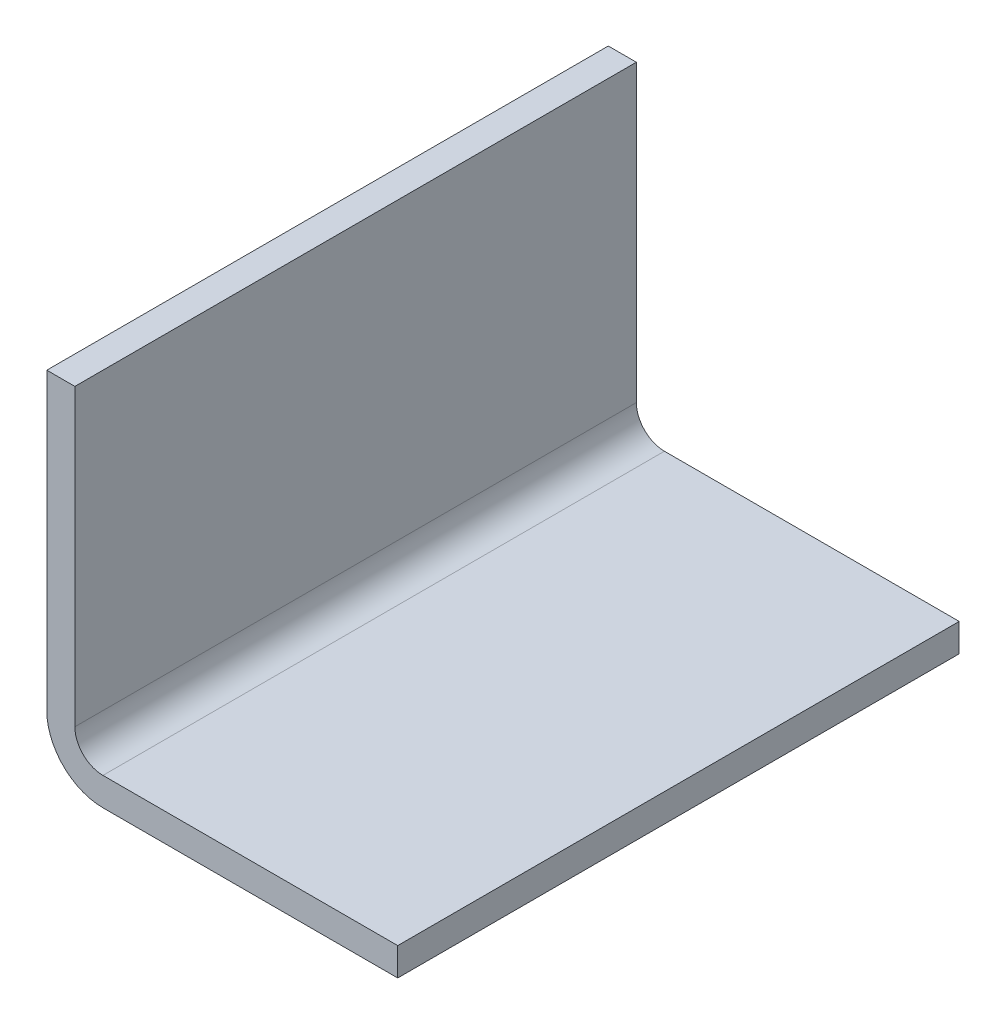
ISO-10303-21;
HEADER;
FILE_DESCRIPTION(('STEP AP214'),'2;1');
FILE_NAME('part.step','',(''),(''),'','','');
FILE_SCHEMA(('AUTOMOTIVE_DESIGN { 1 0 10303 214 1 1 1 1 }'));
ENDSEC;
DATA;
#1=APPLICATION_CONTEXT('core data for automotive mechanical design processes');
#2=APPLICATION_PROTOCOL_DEFINITION('international standard','automotive_design',2000,#1);
#3=PRODUCT_CONTEXT('',#1,'mechanical');
#4=PRODUCT('Part','Part','',(#3));
#5=PRODUCT_RELATED_PRODUCT_CATEGORY('part','',(#4));
#6=PRODUCT_DEFINITION_FORMATION('','',#4);
#7=PRODUCT_DEFINITION_CONTEXT('part definition',#1,'design');
#8=PRODUCT_DEFINITION('design','',#6,#7);
#9=PRODUCT_DEFINITION_SHAPE('','',#8);
#10=(LENGTH_UNIT() NAMED_UNIT(*) SI_UNIT(.MILLI.,.METRE.));
#11=(NAMED_UNIT(*) PLANE_ANGLE_UNIT() SI_UNIT($,.RADIAN.));
#12=(NAMED_UNIT(*) SI_UNIT($,.STERADIAN.) SOLID_ANGLE_UNIT());
#13=UNCERTAINTY_MEASURE_WITH_UNIT(LENGTH_MEASURE(1.E-05),#10,'distance_accuracy_value','');
#14=(GEOMETRIC_REPRESENTATION_CONTEXT(3) GLOBAL_UNCERTAINTY_ASSIGNED_CONTEXT((#13)) GLOBAL_UNIT_ASSIGNED_CONTEXT((#10,
#11,#12)) REPRESENTATION_CONTEXT('',''));
#15=CARTESIAN_POINT('',(0.,0.,0.));
#16=DIRECTION('',(0.,0.,1.));
#17=DIRECTION('',(1.,0.,0.));
#18=AXIS2_PLACEMENT_3D('',#15,#16,#17);
#19=CARTESIAN_POINT('',(0.,25.,20.));
#20=DIRECTION('',(0.,-1.,0.));
#21=DIRECTION('',(0.,0.,-1.));
#22=AXIS2_PLACEMENT_3D('',#19,#20,#21);
#23=PLANE('',#22);
#24=DIRECTION('',(-1.,0.,0.));
#25=VECTOR('',#24,1.);
#26=CARTESIAN_POINT('',(0.,25.,-20.));
#27=LINE('',#26,#25);
#28=CARTESIAN_POINT('',(2.,25.,-20.));
#29=VERTEX_POINT('',#28);
#30=CARTESIAN_POINT('',(0.,25.,-20.));
#31=VERTEX_POINT('',#30);
#32=EDGE_CURVE('E134',#29,#31,#27,.T.);
#33=ORIENTED_EDGE('',*,*,#32,.T.);
#34=DIRECTION('',(0.,0.,-1.));
#35=VECTOR('',#34,1.);
#36=CARTESIAN_POINT('',(0.,25.,20.));
#37=LINE('',#36,#35);
#38=CARTESIAN_POINT('',(0.,25.,20.));
#39=VERTEX_POINT('',#38);
#40=EDGE_CURVE('E11',#39,#31,#37,.T.);
#41=ORIENTED_EDGE('',*,*,#40,.F.);
#42=DIRECTION('',(-1.,0.,0.));
#43=VECTOR('',#42,1.);
#44=CARTESIAN_POINT('',(0.,25.,20.));
#45=LINE('',#44,#43);
#46=CARTESIAN_POINT('',(2.,25.,20.));
#47=VERTEX_POINT('',#46);
#48=EDGE_CURVE('E148',#47,#39,#45,.T.);
#49=ORIENTED_EDGE('',*,*,#48,.F.);
#50=DIRECTION('',(0.,0.,-1.));
#51=VECTOR('',#50,1.);
#52=CARTESIAN_POINT('',(2.,25.,20.));
#53=LINE('',#52,#51);
#54=EDGE_CURVE('E130',#47,#29,#53,.T.);
#55=ORIENTED_EDGE('',*,*,#54,.T.);
#56=EDGE_LOOP('',(#33,#41,#49,#55));
#57=FACE_BOUND('',#56,.T.);
#58=ADVANCED_FACE('F38',(#57),#23,.F.);
#59=CARTESIAN_POINT('',(0.,4.,20.));
#60=DIRECTION('',(1.,0.,0.));
#61=DIRECTION('',(0.,1.,0.));
#62=AXIS2_PLACEMENT_3D('',#59,#60,#61);
#63=PLANE('',#62);
#64=DIRECTION('',(0.,-1.,0.));
#65=VECTOR('',#64,1.);
#66=CARTESIAN_POINT('',(0.,4.,-20.));
#67=LINE('',#66,#65);
#68=CARTESIAN_POINT('',(0.,4.,-20.));
#69=VERTEX_POINT('',#68);
#70=EDGE_CURVE('E137',#31,#69,#67,.T.);
#71=ORIENTED_EDGE('',*,*,#70,.T.);
#72=DIRECTION('',(0.,0.,-1.));
#73=VECTOR('',#72,1.);
#74=CARTESIAN_POINT('',(0.,4.,20.));
#75=LINE('',#74,#73);
#76=CARTESIAN_POINT('',(0.,4.,20.));
#77=VERTEX_POINT('',#76);
#78=EDGE_CURVE('E46',#77,#69,#75,.T.);
#79=ORIENTED_EDGE('',*,*,#78,.F.);
#80=DIRECTION('',(0.,-1.,0.));
#81=VECTOR('',#80,1.);
#82=CARTESIAN_POINT('',(0.,4.,20.));
#83=LINE('',#82,#81);
#84=EDGE_CURVE('E97',#39,#77,#83,.T.);
#85=ORIENTED_EDGE('',*,*,#84,.F.);
#86=ORIENTED_EDGE('',*,*,#40,.T.);
#87=EDGE_LOOP('',(#71,#79,#85,#86));
#88=FACE_BOUND('',#87,.T.);
#89=ADVANCED_FACE('F183',(#88),#63,.F.);
#90=CARTESIAN_POINT('',(4.,4.,20.));
#91=DIRECTION('',(0.,0.,-1.));
#92=DIRECTION('',(-1.,0.,0.));
#93=AXIS2_PLACEMENT_3D('',#90,#91,#92);
#94=CYLINDRICAL_SURFACE('',#93,4.);
#95=CARTESIAN_POINT('',(4.,4.,-20.));
#96=DIRECTION('',(0.,0.,1.));
#97=DIRECTION('',(1.,0.,0.));
#98=AXIS2_PLACEMENT_3D('',#95,#96,#97);
#99=CIRCLE('',#98,4.);
#100=CARTESIAN_POINT('',(4.,0.,-20.));
#101=VERTEX_POINT('',#100);
#102=EDGE_CURVE('E139',#69,#101,#99,.T.);
#103=ORIENTED_EDGE('',*,*,#102,.T.);
#104=DIRECTION('',(0.,0.,-1.));
#105=VECTOR('',#104,1.);
#106=CARTESIAN_POINT('',(4.,0.,20.));
#107=LINE('',#106,#105);
#108=CARTESIAN_POINT('',(4.,0.,20.));
#109=VERTEX_POINT('',#108);
#110=EDGE_CURVE('E155',#109,#101,#107,.T.);
#111=ORIENTED_EDGE('',*,*,#110,.F.);
#112=CARTESIAN_POINT('',(4.,4.,20.));
#113=DIRECTION('',(0.,0.,1.));
#114=DIRECTION('',(1.,0.,0.));
#115=AXIS2_PLACEMENT_3D('',#112,#113,#114);
#116=CIRCLE('',#115,4.);
#117=EDGE_CURVE('E163',#77,#109,#116,.T.);
#118=ORIENTED_EDGE('',*,*,#117,.F.);
#119=ORIENTED_EDGE('',*,*,#78,.T.);
#120=EDGE_LOOP('',(#103,#111,#118,#119));
#121=FACE_BOUND('',#120,.T.);
#122=ADVANCED_FACE('F161',(#121),#94,.T.);
#123=CARTESIAN_POINT('',(25.,0.,20.));
#124=DIRECTION('',(0.,1.,0.));
#125=DIRECTION('',(-1.,0.,0.));
#126=AXIS2_PLACEMENT_3D('',#123,#124,#125);
#127=PLANE('',#126);
#128=DIRECTION('',(1.,0.,0.));
#129=VECTOR('',#128,1.);
#130=CARTESIAN_POINT('',(25.,0.,-20.));
#131=LINE('',#130,#129);
#132=CARTESIAN_POINT('',(25.,0.,-20.));
#133=VERTEX_POINT('',#132);
#134=EDGE_CURVE('E141',#101,#133,#131,.T.);
#135=ORIENTED_EDGE('',*,*,#134,.T.);
#136=DIRECTION('',(0.,0.,-1.));
#137=VECTOR('',#136,1.);
#138=CARTESIAN_POINT('',(25.,0.,20.));
#139=LINE('',#138,#137);
#140=CARTESIAN_POINT('',(25.,0.,20.));
#141=VERTEX_POINT('',#140);
#142=EDGE_CURVE('E152',#141,#133,#139,.T.);
#143=ORIENTED_EDGE('',*,*,#142,.F.);
#144=DIRECTION('',(1.,0.,0.));
#145=VECTOR('',#144,1.);
#146=CARTESIAN_POINT('',(25.,0.,20.));
#147=LINE('',#146,#145);
#148=EDGE_CURVE('E175',#109,#141,#147,.T.);
#149=ORIENTED_EDGE('',*,*,#148,.F.);
#150=ORIENTED_EDGE('',*,*,#110,.T.);
#151=EDGE_LOOP('',(#135,#143,#149,#150));
#152=FACE_BOUND('',#151,.T.);
#153=ADVANCED_FACE('F171',(#152),#127,.F.);
#154=CARTESIAN_POINT('',(25.,2.,20.));
#155=DIRECTION('',(-1.,0.,0.));
#156=DIRECTION('',(0.,0.,1.));
#157=AXIS2_PLACEMENT_3D('',#154,#155,#156);
#158=PLANE('',#157);
#159=DIRECTION('',(0.,1.,0.));
#160=VECTOR('',#159,1.);
#161=CARTESIAN_POINT('',(25.,2.,-20.));
#162=LINE('',#161,#160);
#163=CARTESIAN_POINT('',(25.,2.,-20.));
#164=VERTEX_POINT('',#163);
#165=EDGE_CURVE('E143',#133,#164,#162,.T.);
#166=ORIENTED_EDGE('',*,*,#165,.T.);
#167=DIRECTION('',(0.,0.,-1.));
#168=VECTOR('',#167,1.);
#169=CARTESIAN_POINT('',(25.,2.,20.));
#170=LINE('',#169,#168);
#171=CARTESIAN_POINT('',(25.,2.,20.));
#172=VERTEX_POINT('',#171);
#173=EDGE_CURVE('E125',#172,#164,#170,.T.);
#174=ORIENTED_EDGE('',*,*,#173,.F.);
#175=DIRECTION('',(0.,1.,0.));
#176=VECTOR('',#175,1.);
#177=CARTESIAN_POINT('',(25.,2.,20.));
#178=LINE('',#177,#176);
#179=EDGE_CURVE('E116',#141,#172,#178,.T.);
#180=ORIENTED_EDGE('',*,*,#179,.F.);
#181=ORIENTED_EDGE('',*,*,#142,.T.);
#182=EDGE_LOOP('',(#166,#174,#180,#181));
#183=FACE_BOUND('',#182,.T.);
#184=ADVANCED_FACE('F174',(#183),#158,.F.);
#185=CARTESIAN_POINT('',(4.00000000000002,2.,20.));
#186=DIRECTION('',(0.,-1.,0.));
#187=DIRECTION('',(0.,0.,-1.));
#188=AXIS2_PLACEMENT_3D('',#185,#186,#187);
#189=PLANE('',#188);
#190=DIRECTION('',(-1.,0.,0.));
#191=VECTOR('',#190,1.);
#192=CARTESIAN_POINT('',(4.00000000000002,2.,-20.));
#193=LINE('',#192,#191);
#194=CARTESIAN_POINT('',(4.00000000000002,2.,-20.));
#195=VERTEX_POINT('',#194);
#196=EDGE_CURVE('E124',#164,#195,#193,.T.);
#197=ORIENTED_EDGE('',*,*,#196,.T.);
#198=DIRECTION('',(0.,0.,-1.));
#199=VECTOR('',#198,1.);
#200=CARTESIAN_POINT('',(4.00000000000002,2.,20.));
#201=LINE('',#200,#199);
#202=CARTESIAN_POINT('',(4.00000000000002,2.,20.));
#203=VERTEX_POINT('',#202);
#204=EDGE_CURVE('E121',#203,#195,#201,.T.);
#205=ORIENTED_EDGE('',*,*,#204,.F.);
#206=DIRECTION('',(-1.,0.,0.));
#207=VECTOR('',#206,1.);
#208=CARTESIAN_POINT('',(4.00000000000002,2.,20.));
#209=LINE('',#208,#207);
#210=EDGE_CURVE('E110',#172,#203,#209,.T.);
#211=ORIENTED_EDGE('',*,*,#210,.F.);
#212=ORIENTED_EDGE('',*,*,#173,.T.);
#213=EDGE_LOOP('',(#197,#205,#211,#212));
#214=FACE_BOUND('',#213,.T.);
#215=ADVANCED_FACE('F122',(#214),#189,.F.);
#216=CARTESIAN_POINT('',(4.,4.,20.));
#217=DIRECTION('',(0.,0.,-1.));
#218=DIRECTION('',(-1.,0.,0.));
#219=AXIS2_PLACEMENT_3D('',#216,#217,#218);
#220=CYLINDRICAL_SURFACE('',#219,2.);
#221=CARTESIAN_POINT('',(4.,4.,-20.));
#222=DIRECTION('',(0.,0.,-1.));
#223=DIRECTION('',(1.,0.,0.));
#224=AXIS2_PLACEMENT_3D('',#221,#222,#223);
#225=CIRCLE('',#224,2.);
#226=CARTESIAN_POINT('',(2.,4.00000000000001,-20.));
#227=VERTEX_POINT('',#226);
#228=EDGE_CURVE('E83',#195,#227,#225,.T.);
#229=ORIENTED_EDGE('',*,*,#228,.T.);
#230=DIRECTION('',(0.,0.,-1.));
#231=VECTOR('',#230,1.);
#232=CARTESIAN_POINT('',(2.,4.00000000000001,20.));
#233=LINE('',#232,#231);
#234=CARTESIAN_POINT('',(2.,4.00000000000001,20.));
#235=VERTEX_POINT('',#234);
#236=EDGE_CURVE('E126',#235,#227,#233,.T.);
#237=ORIENTED_EDGE('',*,*,#236,.F.);
#238=CARTESIAN_POINT('',(4.,4.,20.));
#239=DIRECTION('',(0.,0.,-1.));
#240=DIRECTION('',(1.,0.,0.));
#241=AXIS2_PLACEMENT_3D('',#238,#239,#240);
#242=CIRCLE('',#241,2.);
#243=EDGE_CURVE('E114',#203,#235,#242,.T.);
#244=ORIENTED_EDGE('',*,*,#243,.F.);
#245=ORIENTED_EDGE('',*,*,#204,.T.);
#246=EDGE_LOOP('',(#229,#237,#244,#245));
#247=FACE_BOUND('',#246,.T.);
#248=ADVANCED_FACE('F128',(#247),#220,.F.);
#249=CARTESIAN_POINT('',(2.,25.,20.));
#250=DIRECTION('',(-1.,0.,0.));
#251=DIRECTION('',(0.,-1.,0.));
#252=AXIS2_PLACEMENT_3D('',#249,#250,#251);
#253=PLANE('',#252);
#254=DIRECTION('',(0.,1.,0.));
#255=VECTOR('',#254,1.);
#256=CARTESIAN_POINT('',(2.,25.,-20.));
#257=LINE('',#256,#255);
#258=EDGE_CURVE('E89',#227,#29,#257,.T.);
#259=ORIENTED_EDGE('',*,*,#258,.T.);
#260=ORIENTED_EDGE('',*,*,#54,.F.);
#261=DIRECTION('',(0.,1.,0.));
#262=VECTOR('',#261,1.);
#263=CARTESIAN_POINT('',(2.,25.,20.));
#264=LINE('',#263,#262);
#265=EDGE_CURVE('E54',#235,#47,#264,.T.);
#266=ORIENTED_EDGE('',*,*,#265,.F.);
#267=ORIENTED_EDGE('',*,*,#236,.T.);
#268=EDGE_LOOP('',(#259,#260,#266,#267));
#269=FACE_BOUND('',#268,.T.);
#270=ADVANCED_FACE('F199',(#269),#253,.F.);
#271=CARTESIAN_POINT('',(4.,4.,20.));
#272=DIRECTION('',(0.,0.,1.));
#273=DIRECTION('',(1.,0.,0.));
#274=AXIS2_PLACEMENT_3D('',#271,#272,#273);
#275=PLANE('',#274);
#276=ORIENTED_EDGE('',*,*,#48,.T.);
#277=ORIENTED_EDGE('',*,*,#84,.T.);
#278=ORIENTED_EDGE('',*,*,#117,.T.);
#279=ORIENTED_EDGE('',*,*,#148,.T.);
#280=ORIENTED_EDGE('',*,*,#179,.T.);
#281=ORIENTED_EDGE('',*,*,#210,.T.);
#282=ORIENTED_EDGE('',*,*,#243,.T.);
#283=ORIENTED_EDGE('',*,*,#265,.T.);
#284=EDGE_LOOP('',(#276,#277,#278,#279,#280,#281,#282,#283));
#285=FACE_BOUND('',#284,.T.);
#286=ADVANCED_FACE('F112',(#285),#275,.T.);
#287=CARTESIAN_POINT('',(4.,4.,-20.));
#288=DIRECTION('',(0.,0.,1.));
#289=DIRECTION('',(1.,0.,0.));
#290=AXIS2_PLACEMENT_3D('',#287,#288,#289);
#291=PLANE('',#290);
#292=ORIENTED_EDGE('',*,*,#32,.F.);
#293=ORIENTED_EDGE('',*,*,#258,.F.);
#294=ORIENTED_EDGE('',*,*,#228,.F.);
#295=ORIENTED_EDGE('',*,*,#196,.F.);
#296=ORIENTED_EDGE('',*,*,#165,.F.);
#297=ORIENTED_EDGE('',*,*,#134,.F.);
#298=ORIENTED_EDGE('',*,*,#102,.F.);
#299=ORIENTED_EDGE('',*,*,#70,.F.);
#300=EDGE_LOOP('',(#292,#293,#294,#295,#296,#297,#298,#299));
#301=FACE_BOUND('',#300,.T.);
#302=ADVANCED_FACE('F167',(#301),#291,.F.);
#303=CLOSED_SHELL('',(#58,#89,#122,#153,#184,#215,#248,#270,#286,#302));
#304=MANIFOLD_SOLID_BREP('B2',#303);
#305=ADVANCED_BREP_SHAPE_REPRESENTATION('',(#18,#304),#14);
#306=SHAPE_DEFINITION_REPRESENTATION(#9,#305);
ENDSEC;
END-ISO-10303-21;
